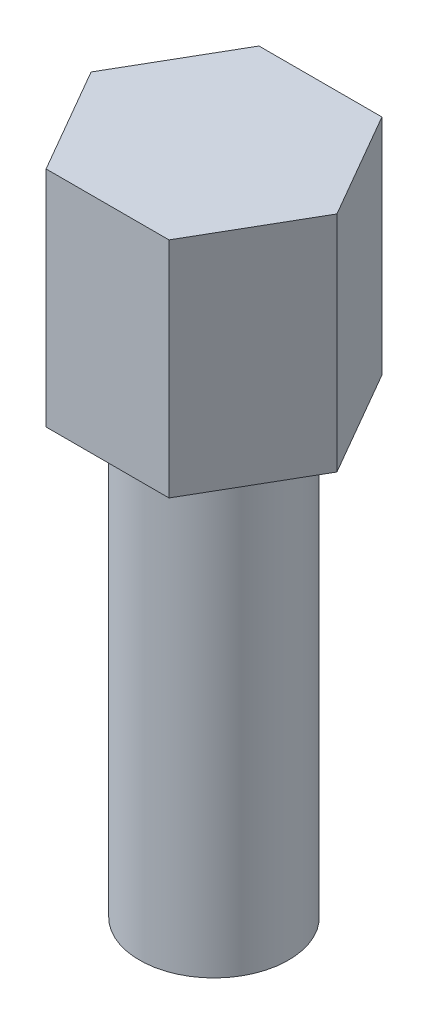
ISO-10303-21;
HEADER;
FILE_DESCRIPTION(('STEP AP214'),'2;1');
FILE_NAME('part.step','',(''),(''),'','','');
FILE_SCHEMA(('AUTOMOTIVE_DESIGN { 1 0 10303 214 1 1 1 1 }'));
ENDSEC;
DATA;
#1=APPLICATION_CONTEXT('core data for automotive mechanical design processes');
#2=APPLICATION_PROTOCOL_DEFINITION('international standard','automotive_design',2000,#1);
#3=PRODUCT_CONTEXT('',#1,'mechanical');
#4=PRODUCT('Part','Part','',(#3));
#5=PRODUCT_RELATED_PRODUCT_CATEGORY('part','',(#4));
#6=PRODUCT_DEFINITION_FORMATION('','',#4);
#7=PRODUCT_DEFINITION_CONTEXT('part definition',#1,'design');
#8=PRODUCT_DEFINITION('design','',#6,#7);
#9=PRODUCT_DEFINITION_SHAPE('','',#8);
#10=(LENGTH_UNIT() NAMED_UNIT(*) SI_UNIT(.MILLI.,.METRE.));
#11=(NAMED_UNIT(*) PLANE_ANGLE_UNIT() SI_UNIT($,.RADIAN.));
#12=(NAMED_UNIT(*) SI_UNIT($,.STERADIAN.) SOLID_ANGLE_UNIT());
#13=UNCERTAINTY_MEASURE_WITH_UNIT(LENGTH_MEASURE(1.E-05),#10,'distance_accuracy_value','');
#14=(GEOMETRIC_REPRESENTATION_CONTEXT(3) GLOBAL_UNCERTAINTY_ASSIGNED_CONTEXT((#13)) GLOBAL_UNIT_ASSIGNED_CONTEXT((#10,
#11,#12)) REPRESENTATION_CONTEXT('',''));
#15=CARTESIAN_POINT('',(0.,0.,0.));
#16=DIRECTION('',(0.,0.,1.));
#17=DIRECTION('',(1.,0.,0.));
#18=AXIS2_PLACEMENT_3D('',#15,#16,#17);
#19=CARTESIAN_POINT('',(0.825,3.,1.42894191624432));
#20=DIRECTION('',(-0.866025403784439,0.,-0.5));
#21=DIRECTION('',(-0.5,0.,0.866025403784439));
#22=AXIS2_PLACEMENT_3D('',#19,#20,#21);
#23=PLANE('',#22);
#24=DIRECTION('',(0.5,0.,-0.866025403784439));
#25=VECTOR('',#24,1.);
#26=CARTESIAN_POINT('',(0.825,0.,1.42894191624432));
#27=LINE('',#26,#25);
#28=CARTESIAN_POINT('',(0.825,0.,1.42894191624432));
#29=VERTEX_POINT('',#28);
#30=CARTESIAN_POINT('',(1.65,0.,0.));
#31=VERTEX_POINT('',#30);
#32=EDGE_CURVE('E143',#29,#31,#27,.T.);
#33=ORIENTED_EDGE('',*,*,#32,.T.);
#34=DIRECTION('',(0.,-1.,0.));
#35=VECTOR('',#34,1.);
#36=CARTESIAN_POINT('',(1.65,3.,0.));
#37=LINE('',#36,#35);
#38=CARTESIAN_POINT('',(1.65,3.,0.));
#39=VERTEX_POINT('',#38);
#40=EDGE_CURVE('E42',#39,#31,#37,.T.);
#41=ORIENTED_EDGE('',*,*,#40,.F.);
#42=DIRECTION('',(0.5,0.,-0.866025403784439));
#43=VECTOR('',#42,1.);
#44=CARTESIAN_POINT('',(0.825,3.,1.42894191624432));
#45=LINE('',#44,#43);
#46=CARTESIAN_POINT('',(0.825,3.,1.42894191624432));
#47=VERTEX_POINT('',#46);
#48=EDGE_CURVE('E160',#47,#39,#45,.T.);
#49=ORIENTED_EDGE('',*,*,#48,.F.);
#50=DIRECTION('',(0.,-1.,0.));
#51=VECTOR('',#50,1.);
#52=CARTESIAN_POINT('',(0.825,3.,1.42894191624432));
#53=LINE('',#52,#51);
#54=EDGE_CURVE('E139',#47,#29,#53,.T.);
#55=ORIENTED_EDGE('',*,*,#54,.T.);
#56=EDGE_LOOP('',(#33,#41,#49,#55));
#57=FACE_BOUND('',#56,.T.);
#58=ADVANCED_FACE('F39',(#57),#23,.F.);
#59=CARTESIAN_POINT('',(1.65,3.,0.));
#60=DIRECTION('',(-0.866025403784439,0.,0.5));
#61=DIRECTION('',(0.5,0.,0.866025403784439));
#62=AXIS2_PLACEMENT_3D('',#59,#60,#61);
#63=PLANE('',#62);
#64=DIRECTION('',(-0.5,0.,-0.866025403784439));
#65=VECTOR('',#64,1.);
#66=CARTESIAN_POINT('',(1.65,0.,0.));
#67=LINE('',#66,#65);
#68=CARTESIAN_POINT('',(0.825,0.,-1.42894191624432));
#69=VERTEX_POINT('',#68);
#70=EDGE_CURVE('E147',#31,#69,#67,.T.);
#71=ORIENTED_EDGE('',*,*,#70,.T.);
#72=DIRECTION('',(0.,-1.,0.));
#73=VECTOR('',#72,1.);
#74=CARTESIAN_POINT('',(0.825,3.,-1.42894191624432));
#75=LINE('',#74,#73);
#76=CARTESIAN_POINT('',(0.825,3.,-1.42894191624432));
#77=VERTEX_POINT('',#76);
#78=EDGE_CURVE('E165',#77,#69,#75,.T.);
#79=ORIENTED_EDGE('',*,*,#78,.F.);
#80=DIRECTION('',(-0.5,0.,-0.866025403784439));
#81=VECTOR('',#80,1.);
#82=CARTESIAN_POINT('',(1.65,3.,0.));
#83=LINE('',#82,#81);
#84=EDGE_CURVE('E106',#39,#77,#83,.T.);
#85=ORIENTED_EDGE('',*,*,#84,.F.);
#86=ORIENTED_EDGE('',*,*,#40,.T.);
#87=EDGE_LOOP('',(#71,#79,#85,#86));
#88=FACE_BOUND('',#87,.T.);
#89=ADVANCED_FACE('F174',(#88),#63,.F.);
#90=CARTESIAN_POINT('',(0.825,3.,-1.42894191624432));
#91=DIRECTION('',(0.,0.,1.));
#92=DIRECTION('',(1.,0.,0.));
#93=AXIS2_PLACEMENT_3D('',#90,#91,#92);
#94=PLANE('',#93);
#95=DIRECTION('',(-1.,0.,0.));
#96=VECTOR('',#95,1.);
#97=CARTESIAN_POINT('',(0.825,0.,-1.42894191624432));
#98=LINE('',#97,#96);
#99=CARTESIAN_POINT('',(-0.825,0.,-1.42894191624432));
#100=VERTEX_POINT('',#99);
#101=EDGE_CURVE('E151',#69,#100,#98,.T.);
#102=ORIENTED_EDGE('',*,*,#101,.T.);
#103=DIRECTION('',(0.,-1.,0.));
#104=VECTOR('',#103,1.);
#105=CARTESIAN_POINT('',(-0.825,3.,-1.42894191624432));
#106=LINE('',#105,#104);
#107=CARTESIAN_POINT('',(-0.825,3.,-1.42894191624432));
#108=VERTEX_POINT('',#107);
#109=EDGE_CURVE('E131',#108,#100,#106,.T.);
#110=ORIENTED_EDGE('',*,*,#109,.F.);
#111=DIRECTION('',(-1.,0.,0.));
#112=VECTOR('',#111,1.);
#113=CARTESIAN_POINT('',(0.825,3.,-1.42894191624432));
#114=LINE('',#113,#112);
#115=EDGE_CURVE('E120',#77,#108,#114,.T.);
#116=ORIENTED_EDGE('',*,*,#115,.F.);
#117=ORIENTED_EDGE('',*,*,#78,.T.);
#118=EDGE_LOOP('',(#102,#110,#116,#117));
#119=FACE_BOUND('',#118,.T.);
#120=ADVANCED_FACE('F180',(#119),#94,.F.);
#121=CARTESIAN_POINT('',(-0.825,3.,-1.42894191624432));
#122=DIRECTION('',(0.866025403784438,0.,0.5));
#123=DIRECTION('',(0.5,0.,-0.866025403784439));
#124=AXIS2_PLACEMENT_3D('',#121,#122,#123);
#125=PLANE('',#124);
#126=DIRECTION('',(-0.5,0.,0.866025403784439));
#127=VECTOR('',#126,1.);
#128=CARTESIAN_POINT('',(-0.825,0.,-1.42894191624432));
#129=LINE('',#128,#127);
#130=CARTESIAN_POINT('',(-1.65,0.,0.));
#131=VERTEX_POINT('',#130);
#132=EDGE_CURVE('E129',#100,#131,#129,.T.);
#133=ORIENTED_EDGE('',*,*,#132,.T.);
#134=DIRECTION('',(0.,-1.,0.));
#135=VECTOR('',#134,1.);
#136=CARTESIAN_POINT('',(-1.65,3.,0.));
#137=LINE('',#136,#135);
#138=CARTESIAN_POINT('',(-1.65,3.,0.));
#139=VERTEX_POINT('',#138);
#140=EDGE_CURVE('E126',#139,#131,#137,.T.);
#141=ORIENTED_EDGE('',*,*,#140,.F.);
#142=DIRECTION('',(-0.5,0.,0.866025403784439));
#143=VECTOR('',#142,1.);
#144=CARTESIAN_POINT('',(-0.825,3.,-1.42894191624432));
#145=LINE('',#144,#143);
#146=EDGE_CURVE('E114',#108,#139,#145,.T.);
#147=ORIENTED_EDGE('',*,*,#146,.F.);
#148=ORIENTED_EDGE('',*,*,#109,.T.);
#149=EDGE_LOOP('',(#133,#141,#147,#148));
#150=FACE_BOUND('',#149,.T.);
#151=ADVANCED_FACE('F127',(#150),#125,.F.);
#152=CARTESIAN_POINT('',(-1.65,3.,0.));
#153=DIRECTION('',(0.866025403784439,0.,-0.5));
#154=DIRECTION('',(-0.5,0.,-0.866025403784439));
#155=AXIS2_PLACEMENT_3D('',#152,#153,#154);
#156=PLANE('',#155);
#157=DIRECTION('',(0.5,0.,0.866025403784439));
#158=VECTOR('',#157,1.);
#159=CARTESIAN_POINT('',(-1.65,0.,0.));
#160=LINE('',#159,#158);
#161=CARTESIAN_POINT('',(-0.825000000000001,0.,1.42894191624432));
#162=VERTEX_POINT('',#161);
#163=EDGE_CURVE('E89',#131,#162,#160,.T.);
#164=ORIENTED_EDGE('',*,*,#163,.T.);
#165=DIRECTION('',(0.,-1.,0.));
#166=VECTOR('',#165,1.);
#167=CARTESIAN_POINT('',(-0.825000000000001,3.,1.42894191624432));
#168=LINE('',#167,#166);
#169=CARTESIAN_POINT('',(-0.825000000000001,3.,1.42894191624432));
#170=VERTEX_POINT('',#169);
#171=EDGE_CURVE('E132',#170,#162,#168,.T.);
#172=ORIENTED_EDGE('',*,*,#171,.F.);
#173=DIRECTION('',(0.5,0.,0.866025403784439));
#174=VECTOR('',#173,1.);
#175=CARTESIAN_POINT('',(-1.65,3.,0.));
#176=LINE('',#175,#174);
#177=EDGE_CURVE('E118',#139,#170,#176,.T.);
#178=ORIENTED_EDGE('',*,*,#177,.F.);
#179=ORIENTED_EDGE('',*,*,#140,.T.);
#180=EDGE_LOOP('',(#164,#172,#178,#179));
#181=FACE_BOUND('',#180,.T.);
#182=ADVANCED_FACE('F134',(#181),#156,.F.);
#183=CARTESIAN_POINT('',(-0.825000000000001,3.,1.42894191624432));
#184=DIRECTION('',(0.,0.,-1.));
#185=DIRECTION('',(-1.,0.,0.));
#186=AXIS2_PLACEMENT_3D('',#183,#184,#185);
#187=PLANE('',#186);
#188=DIRECTION('',(1.,0.,0.));
#189=VECTOR('',#188,1.);
#190=CARTESIAN_POINT('',(-0.825000000000001,0.,1.42894191624432));
#191=LINE('',#190,#189);
#192=EDGE_CURVE('E96',#162,#29,#191,.T.);
#193=ORIENTED_EDGE('',*,*,#192,.T.);
#194=ORIENTED_EDGE('',*,*,#54,.F.);
#195=DIRECTION('',(1.,0.,0.));
#196=VECTOR('',#195,1.);
#197=CARTESIAN_POINT('',(-0.825000000000001,3.,1.42894191624432));
#198=LINE('',#197,#196);
#199=EDGE_CURVE('E60',#170,#47,#198,.T.);
#200=ORIENTED_EDGE('',*,*,#199,.F.);
#201=ORIENTED_EDGE('',*,*,#171,.T.);
#202=EDGE_LOOP('',(#193,#194,#200,#201));
#203=FACE_BOUND('',#202,.T.);
#204=ADVANCED_FACE('F202',(#203),#187,.F.);
#205=CARTESIAN_POINT('',(0.,3.,0.));
#206=DIRECTION('',(0.,1.,0.));
#207=DIRECTION('',(0.,0.,1.));
#208=AXIS2_PLACEMENT_3D('',#205,#206,#207);
#209=PLANE('',#208);
#210=ORIENTED_EDGE('',*,*,#48,.T.);
#211=ORIENTED_EDGE('',*,*,#84,.T.);
#212=ORIENTED_EDGE('',*,*,#115,.T.);
#213=ORIENTED_EDGE('',*,*,#146,.T.);
#214=ORIENTED_EDGE('',*,*,#177,.T.);
#215=ORIENTED_EDGE('',*,*,#199,.T.);
#216=EDGE_LOOP('',(#210,#211,#212,#213,#214,#215));
#217=FACE_BOUND('',#216,.T.);
#218=ADVANCED_FACE('F116',(#217),#209,.T.);
#219=CARTESIAN_POINT('',(0.,0.,0.));
#220=DIRECTION('',(0.,1.,0.));
#221=DIRECTION('',(0.,0.,1.));
#222=AXIS2_PLACEMENT_3D('',#219,#220,#221);
#223=PLANE('',#222);
#224=CARTESIAN_POINT('',(0.,0.,0.));
#225=DIRECTION('',(0.,-1.,0.));
#226=DIRECTION('',(0.,0.,-1.));
#227=AXIS2_PLACEMENT_3D('',#224,#225,#226);
#228=CIRCLE('',#227,1.);
#229=CARTESIAN_POINT('',(0.,0.,-1.));
#230=VERTEX_POINT('',#229);
#231=EDGE_CURVE('E11',#230,#230,#228,.T.);
#232=ORIENTED_EDGE('',*,*,#231,.F.);
#233=EDGE_LOOP('',(#232));
#234=FACE_BOUND('',#233,.T.);
#235=ORIENTED_EDGE('',*,*,#32,.F.);
#236=ORIENTED_EDGE('',*,*,#192,.F.);
#237=ORIENTED_EDGE('',*,*,#163,.F.);
#238=ORIENTED_EDGE('',*,*,#132,.F.);
#239=ORIENTED_EDGE('',*,*,#101,.F.);
#240=ORIENTED_EDGE('',*,*,#70,.F.);
#241=EDGE_LOOP('',(#235,#236,#237,#238,#239,#240));
#242=FACE_BOUND('',#241,.T.);
#243=ADVANCED_FACE('F179',(#234,#242),#223,.F.);
#244=CARTESIAN_POINT('',(0.,-6.,0.));
#245=DIRECTION('',(0.,1.,0.));
#246=DIRECTION('',(0.,0.,1.));
#247=AXIS2_PLACEMENT_3D('',#244,#245,#246);
#248=CYLINDRICAL_SURFACE('',#247,1.);
#249=CARTESIAN_POINT('',(0.,-6.,0.));
#250=DIRECTION('',(0.,-1.,0.));
#251=DIRECTION('',(0.,0.,-1.));
#252=AXIS2_PLACEMENT_3D('',#249,#250,#251);
#253=CIRCLE('',#252,1.);
#254=CARTESIAN_POINT('',(0.,-6.,-1.));
#255=VERTEX_POINT('',#254);
#256=EDGE_CURVE('E148',#255,#255,#253,.T.);
#257=ORIENTED_EDGE('',*,*,#256,.F.);
#258=EDGE_LOOP('',(#257));
#259=FACE_BOUND('',#258,.T.);
#260=ORIENTED_EDGE('',*,*,#231,.T.);
#261=EDGE_LOOP('',(#260));
#262=FACE_BOUND('',#261,.T.);
#263=ADVANCED_FACE('F191',(#259,#262),#248,.T.);
#264=CARTESIAN_POINT('',(0.,-6.,0.));
#265=DIRECTION('',(0.,-1.,0.));
#266=DIRECTION('',(0.,0.,-1.));
#267=AXIS2_PLACEMENT_3D('',#264,#265,#266);
#268=PLANE('',#267);
#269=ORIENTED_EDGE('',*,*,#256,.T.);
#270=EDGE_LOOP('',(#269));
#271=FACE_BOUND('',#270,.T.);
#272=ADVANCED_FACE('F189',(#271),#268,.T.);
#273=CLOSED_SHELL('',(#58,#89,#120,#151,#182,#204,#218,#243,#263,#272));
#274=MANIFOLD_SOLID_BREP('B2',#273);
#275=ADVANCED_BREP_SHAPE_REPRESENTATION('',(#18,#274),#14);
#276=SHAPE_DEFINITION_REPRESENTATION(#9,#275);
ENDSEC;
END-ISO-10303-21;
